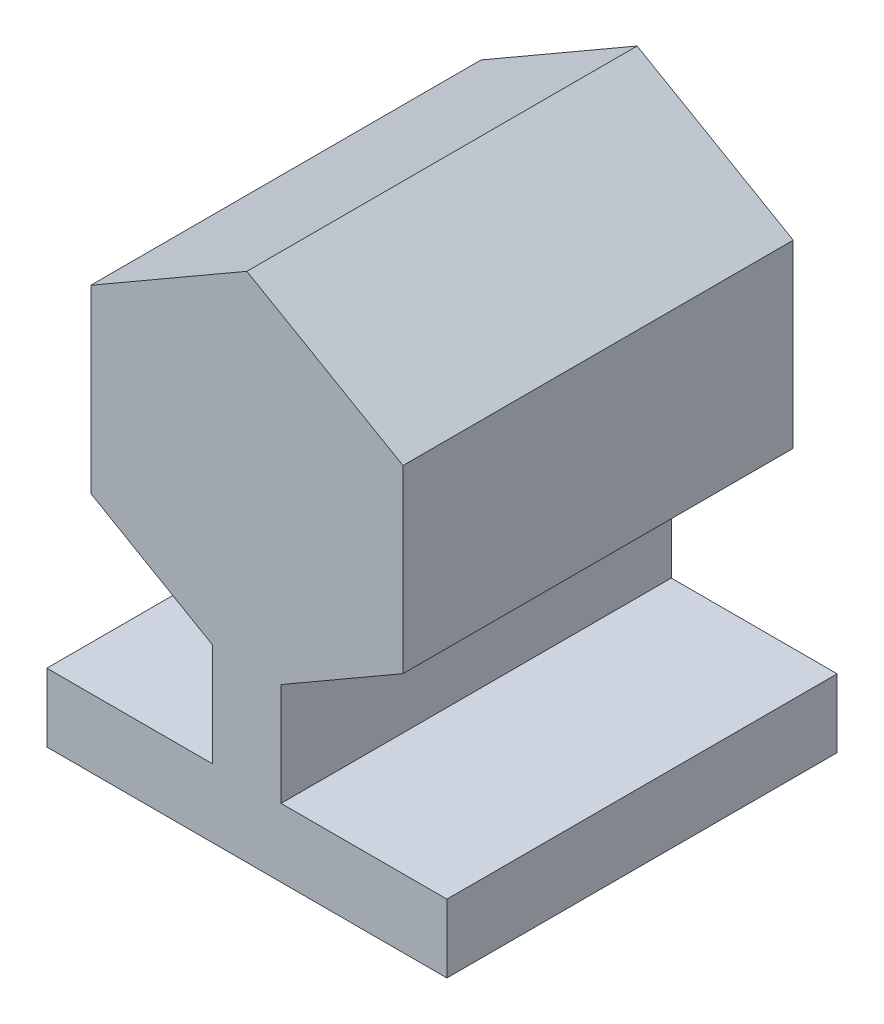
ISO-10303-21;
HEADER;
FILE_DESCRIPTION(('STEP AP214'),'2;1');
FILE_NAME('part.step','',(''),(''),'','','');
FILE_SCHEMA(('AUTOMOTIVE_DESIGN { 1 0 10303 214 1 1 1 1 }'));
ENDSEC;
DATA;
#1=APPLICATION_CONTEXT('core data for automotive mechanical design processes');
#2=APPLICATION_PROTOCOL_DEFINITION('international standard','automotive_design',2000,#1);
#3=PRODUCT_CONTEXT('',#1,'mechanical');
#4=PRODUCT('Part','Part','',(#3));
#5=PRODUCT_RELATED_PRODUCT_CATEGORY('part','',(#4));
#6=PRODUCT_DEFINITION_FORMATION('','',#4);
#7=PRODUCT_DEFINITION_CONTEXT('part definition',#1,'design');
#8=PRODUCT_DEFINITION('design','',#6,#7);
#9=PRODUCT_DEFINITION_SHAPE('','',#8);
#10=(LENGTH_UNIT() NAMED_UNIT(*) SI_UNIT(.MILLI.,.METRE.));
#11=(NAMED_UNIT(*) PLANE_ANGLE_UNIT() SI_UNIT($,.RADIAN.));
#12=(NAMED_UNIT(*) SI_UNIT($,.STERADIAN.) SOLID_ANGLE_UNIT());
#13=UNCERTAINTY_MEASURE_WITH_UNIT(LENGTH_MEASURE(1.E-05),#10,'distance_accuracy_value','');
#14=(GEOMETRIC_REPRESENTATION_CONTEXT(3) GLOBAL_UNCERTAINTY_ASSIGNED_CONTEXT((#13)) GLOBAL_UNIT_ASSIGNED_CONTEXT((#10,
#11,#12)) REPRESENTATION_CONTEXT('',''));
#15=CARTESIAN_POINT('',(0.,0.,0.));
#16=DIRECTION('',(0.,0.,1.));
#17=DIRECTION('',(1.,0.,0.));
#18=AXIS2_PLACEMENT_3D('',#15,#16,#17);
#19=CARTESIAN_POINT('',(-102500.,-170000.,200000.));
#20=DIRECTION('',(1.,0.,0.));
#21=DIRECTION('',(0.,0.,-1.));
#22=AXIS2_PLACEMENT_3D('',#19,#20,#21);
#23=PLANE('',#22);
#24=DIRECTION('',(0.,-1.,0.));
#25=VECTOR('',#24,1.);
#26=CARTESIAN_POINT('',(-102500.,-170000.,0.));
#27=LINE('',#26,#25);
#28=CARTESIAN_POINT('',(-102500.,-135000.,0.));
#29=VERTEX_POINT('',#28);
#30=CARTESIAN_POINT('',(-102500.,-170000.,0.));
#31=VERTEX_POINT('',#30);
#32=EDGE_CURVE('E159',#29,#31,#27,.T.);
#33=ORIENTED_EDGE('',*,*,#32,.T.);
#34=DIRECTION('',(0.,0.,-1.));
#35=VECTOR('',#34,1.);
#36=CARTESIAN_POINT('',(-102500.,-170000.,200000.));
#37=LINE('',#36,#35);
#38=CARTESIAN_POINT('',(-102500.,-170000.,200000.));
#39=VERTEX_POINT('',#38);
#40=EDGE_CURVE('E11',#39,#31,#37,.T.);
#41=ORIENTED_EDGE('',*,*,#40,.F.);
#42=DIRECTION('',(0.,-1.,0.));
#43=VECTOR('',#42,1.);
#44=CARTESIAN_POINT('',(-102500.,-170000.,200000.));
#45=LINE('',#44,#43);
#46=CARTESIAN_POINT('',(-102500.,-135000.,200000.));
#47=VERTEX_POINT('',#46);
#48=EDGE_CURVE('E183',#47,#39,#45,.T.);
#49=ORIENTED_EDGE('',*,*,#48,.F.);
#50=DIRECTION('',(0.,0.,-1.));
#51=VECTOR('',#50,1.);
#52=CARTESIAN_POINT('',(-102500.,-135000.,200000.));
#53=LINE('',#52,#51);
#54=EDGE_CURVE('E155',#47,#29,#53,.T.);
#55=ORIENTED_EDGE('',*,*,#54,.T.);
#56=EDGE_LOOP('',(#33,#41,#49,#55));
#57=FACE_BOUND('',#56,.T.);
#58=ADVANCED_FACE('F33',(#57),#23,.F.);
#59=CARTESIAN_POINT('',(-102500.,-170000.,200000.));
#60=DIRECTION('',(0.,1.,0.));
#61=DIRECTION('',(0.,0.,1.));
#62=AXIS2_PLACEMENT_3D('',#59,#60,#61);
#63=PLANE('',#62);
#64=DIRECTION('',(1.,0.,0.));
#65=VECTOR('',#64,1.);
#66=CARTESIAN_POINT('',(-102500.,-170000.,0.));
#67=LINE('',#66,#65);
#68=CARTESIAN_POINT('',(102500.,-170000.,0.));
#69=VERTEX_POINT('',#68);
#70=EDGE_CURVE('E162',#31,#69,#67,.T.);
#71=ORIENTED_EDGE('',*,*,#70,.T.);
#72=DIRECTION('',(0.,0.,-1.));
#73=VECTOR('',#72,1.);
#74=CARTESIAN_POINT('',(102500.,-170000.,200000.));
#75=LINE('',#74,#73);
#76=CARTESIAN_POINT('',(102500.,-170000.,200000.));
#77=VERTEX_POINT('',#76);
#78=EDGE_CURVE('E41',#77,#69,#75,.T.);
#79=ORIENTED_EDGE('',*,*,#78,.F.);
#80=DIRECTION('',(1.,0.,0.));
#81=VECTOR('',#80,1.);
#82=CARTESIAN_POINT('',(-102500.,-170000.,200000.));
#83=LINE('',#82,#81);
#84=EDGE_CURVE('E107',#39,#77,#83,.T.);
#85=ORIENTED_EDGE('',*,*,#84,.F.);
#86=ORIENTED_EDGE('',*,*,#40,.T.);
#87=EDGE_LOOP('',(#71,#79,#85,#86));
#88=FACE_BOUND('',#87,.T.);
#89=ADVANCED_FACE('F266',(#88),#63,.F.);
#90=CARTESIAN_POINT('',(102500.,-170000.,200000.));
#91=DIRECTION('',(-1.,0.,0.));
#92=DIRECTION('',(0.,0.,1.));
#93=AXIS2_PLACEMENT_3D('',#90,#91,#92);
#94=PLANE('',#93);
#95=DIRECTION('',(0.,1.,0.));
#96=VECTOR('',#95,1.);
#97=CARTESIAN_POINT('',(102500.,-170000.,0.));
#98=LINE('',#97,#96);
#99=CARTESIAN_POINT('',(102500.,-135000.,0.));
#100=VERTEX_POINT('',#99);
#101=EDGE_CURVE('E164',#69,#100,#98,.T.);
#102=ORIENTED_EDGE('',*,*,#101,.T.);
#103=DIRECTION('',(0.,0.,-1.));
#104=VECTOR('',#103,1.);
#105=CARTESIAN_POINT('',(102500.,-135000.,200000.));
#106=LINE('',#105,#104);
#107=CARTESIAN_POINT('',(102500.,-135000.,200000.));
#108=VERTEX_POINT('',#107);
#109=EDGE_CURVE('E205',#108,#100,#106,.T.);
#110=ORIENTED_EDGE('',*,*,#109,.F.);
#111=DIRECTION('',(0.,1.,0.));
#112=VECTOR('',#111,1.);
#113=CARTESIAN_POINT('',(102500.,-170000.,200000.));
#114=LINE('',#113,#112);
#115=EDGE_CURVE('E213',#77,#108,#114,.T.);
#116=ORIENTED_EDGE('',*,*,#115,.F.);
#117=ORIENTED_EDGE('',*,*,#78,.T.);
#118=EDGE_LOOP('',(#102,#110,#116,#117));
#119=FACE_BOUND('',#118,.T.);
#120=ADVANCED_FACE('F211',(#119),#94,.F.);
#121=CARTESIAN_POINT('',(102500.,-135000.,200000.));
#122=DIRECTION('',(0.,-1.,0.));
#123=DIRECTION('',(1.,0.,0.));
#124=AXIS2_PLACEMENT_3D('',#121,#122,#123);
#125=PLANE('',#124);
#126=DIRECTION('',(-1.,0.,0.));
#127=VECTOR('',#126,1.);
#128=CARTESIAN_POINT('',(102500.,-135000.,0.));
#129=LINE('',#128,#127);
#130=CARTESIAN_POINT('',(17500.,-135000.,0.));
#131=VERTEX_POINT('',#130);
#132=EDGE_CURVE('E166',#100,#131,#129,.T.);
#133=ORIENTED_EDGE('',*,*,#132,.T.);
#134=DIRECTION('',(0.,0.,-1.));
#135=VECTOR('',#134,1.);
#136=CARTESIAN_POINT('',(17500.,-135000.,200000.));
#137=LINE('',#136,#135);
#138=CARTESIAN_POINT('',(17500.,-135000.,200000.));
#139=VERTEX_POINT('',#138);
#140=EDGE_CURVE('E202',#139,#131,#137,.T.);
#141=ORIENTED_EDGE('',*,*,#140,.F.);
#142=DIRECTION('',(-1.,0.,0.));
#143=VECTOR('',#142,1.);
#144=CARTESIAN_POINT('',(102500.,-135000.,200000.));
#145=LINE('',#144,#143);
#146=EDGE_CURVE('E231',#108,#139,#145,.T.);
#147=ORIENTED_EDGE('',*,*,#146,.F.);
#148=ORIENTED_EDGE('',*,*,#109,.T.);
#149=EDGE_LOOP('',(#133,#141,#147,#148));
#150=FACE_BOUND('',#149,.T.);
#151=ADVANCED_FACE('F222',(#150),#125,.F.);
#152=CARTESIAN_POINT('',(17500.,-135000.,200000.));
#153=DIRECTION('',(-1.,0.,0.));
#154=DIRECTION('',(0.,0.,1.));
#155=AXIS2_PLACEMENT_3D('',#152,#153,#154);
#156=PLANE('',#155);
#157=DIRECTION('',(0.,1.,0.));
#158=VECTOR('',#157,1.);
#159=CARTESIAN_POINT('',(17500.,-135000.,0.));
#160=LINE('',#159,#158);
#161=CARTESIAN_POINT('',(17500.,-82272.4133595217,0.));
#162=VERTEX_POINT('',#161);
#163=EDGE_CURVE('E168',#131,#162,#160,.T.);
#164=ORIENTED_EDGE('',*,*,#163,.T.);
#165=DIRECTION('',(0.,0.,-1.));
#166=VECTOR('',#165,1.);
#167=CARTESIAN_POINT('',(17500.,-82272.4133595217,200000.));
#168=LINE('',#167,#166);
#169=CARTESIAN_POINT('',(17500.,-82272.4133595217,200000.));
#170=VERTEX_POINT('',#169);
#171=EDGE_CURVE('E199',#170,#162,#168,.T.);
#172=ORIENTED_EDGE('',*,*,#171,.F.);
#173=DIRECTION('',(0.,1.,0.));
#174=VECTOR('',#173,1.);
#175=CARTESIAN_POINT('',(17500.,-135000.,200000.));
#176=LINE('',#175,#174);
#177=EDGE_CURVE('E228',#139,#170,#176,.T.);
#178=ORIENTED_EDGE('',*,*,#177,.F.);
#179=ORIENTED_EDGE('',*,*,#140,.T.);
#180=EDGE_LOOP('',(#164,#172,#178,#179));
#181=FACE_BOUND('',#180,.T.);
#182=ADVANCED_FACE('F226',(#181),#156,.F.);
#183=CARTESIAN_POINT('',(17500.,-82272.4133595217,200000.));
#184=DIRECTION('',(-0.5,0.866025403784438,0.));
#185=DIRECTION('',(-0.866025403784438,-0.5,0.));
#186=AXIS2_PLACEMENT_3D('',#183,#184,#185);
#187=PLANE('',#186);
#188=DIRECTION('',(0.866025403784438,0.5,0.));
#189=VECTOR('',#188,1.);
#190=CARTESIAN_POINT('',(17500.,-82272.4133595217,0.));
#191=LINE('',#190,#189);
#192=CARTESIAN_POINT('',(80000.,-46188.02153517,0.));
#193=VERTEX_POINT('',#192);
#194=EDGE_CURVE('E170',#162,#193,#191,.T.);
#195=ORIENTED_EDGE('',*,*,#194,.T.);
#196=DIRECTION('',(0.,0.,-1.));
#197=VECTOR('',#196,1.);
#198=CARTESIAN_POINT('',(80000.,-46188.02153517,200000.));
#199=LINE('',#198,#197);
#200=CARTESIAN_POINT('',(80000.,-46188.02153517,200000.));
#201=VERTEX_POINT('',#200);
#202=EDGE_CURVE('E196',#201,#193,#199,.T.);
#203=ORIENTED_EDGE('',*,*,#202,.F.);
#204=DIRECTION('',(0.866025403784438,0.5,0.));
#205=VECTOR('',#204,1.);
#206=CARTESIAN_POINT('',(17500.,-82272.4133595217,200000.));
#207=LINE('',#206,#205);
#208=EDGE_CURVE('E230',#170,#201,#207,.T.);
#209=ORIENTED_EDGE('',*,*,#208,.F.);
#210=ORIENTED_EDGE('',*,*,#171,.T.);
#211=EDGE_LOOP('',(#195,#203,#209,#210));
#212=FACE_BOUND('',#211,.T.);
#213=ADVANCED_FACE('F279',(#212),#187,.F.);
#214=CARTESIAN_POINT('',(80000.,-46188.02153517,200000.));
#215=DIRECTION('',(-1.,0.,0.));
#216=DIRECTION('',(0.,-1.,0.));
#217=AXIS2_PLACEMENT_3D('',#214,#215,#216);
#218=PLANE('',#217);
#219=DIRECTION('',(0.,1.,0.));
#220=VECTOR('',#219,1.);
#221=CARTESIAN_POINT('',(80000.,-46188.02153517,0.));
#222=LINE('',#221,#220);
#223=CARTESIAN_POINT('',(80000.,46188.0215351701,0.));
#224=VERTEX_POINT('',#223);
#225=EDGE_CURVE('E172',#193,#224,#222,.T.);
#226=ORIENTED_EDGE('',*,*,#225,.T.);
#227=DIRECTION('',(0.,0.,-1.));
#228=VECTOR('',#227,1.);
#229=CARTESIAN_POINT('',(80000.,46188.0215351701,200000.));
#230=LINE('',#229,#228);
#231=CARTESIAN_POINT('',(80000.,46188.0215351701,200000.));
#232=VERTEX_POINT('',#231);
#233=EDGE_CURVE('E193',#232,#224,#230,.T.);
#234=ORIENTED_EDGE('',*,*,#233,.F.);
#235=DIRECTION('',(0.,1.,0.));
#236=VECTOR('',#235,1.);
#237=CARTESIAN_POINT('',(80000.,-46188.02153517,200000.));
#238=LINE('',#237,#236);
#239=EDGE_CURVE('E233',#201,#232,#238,.T.);
#240=ORIENTED_EDGE('',*,*,#239,.F.);
#241=ORIENTED_EDGE('',*,*,#202,.T.);
#242=EDGE_LOOP('',(#226,#234,#240,#241));
#243=FACE_BOUND('',#242,.T.);
#244=ADVANCED_FACE('F282',(#243),#218,.F.);
#245=CARTESIAN_POINT('',(80000.,46188.0215351701,200000.));
#246=DIRECTION('',(-0.5,-0.866025403784439,0.));
#247=DIRECTION('',(0.866025403784439,-0.5,0.));
#248=AXIS2_PLACEMENT_3D('',#245,#246,#247);
#249=PLANE('',#248);
#250=DIRECTION('',(-0.866025403784439,0.5,0.));
#251=VECTOR('',#250,1.);
#252=CARTESIAN_POINT('',(80000.,46188.0215351701,0.));
#253=LINE('',#252,#251);
#254=CARTESIAN_POINT('',(-2.87773574786147E-11,92376.0430703402,0.));
#255=VERTEX_POINT('',#254);
#256=EDGE_CURVE('E174',#224,#255,#253,.T.);
#257=ORIENTED_EDGE('',*,*,#256,.T.);
#258=DIRECTION('',(0.,0.,-1.));
#259=VECTOR('',#258,1.);
#260=CARTESIAN_POINT('',(-2.87773574786147E-11,92376.0430703402,200000.));
#261=LINE('',#260,#259);
#262=CARTESIAN_POINT('',(-2.87773574786147E-11,92376.0430703402,200000.));
#263=VERTEX_POINT('',#262);
#264=EDGE_CURVE('E190',#263,#255,#261,.T.);
#265=ORIENTED_EDGE('',*,*,#264,.F.);
#266=DIRECTION('',(-0.866025403784439,0.5,0.));
#267=VECTOR('',#266,1.);
#268=CARTESIAN_POINT('',(80000.,46188.0215351701,200000.));
#269=LINE('',#268,#267);
#270=EDGE_CURVE('E239',#232,#263,#269,.T.);
#271=ORIENTED_EDGE('',*,*,#270,.F.);
#272=ORIENTED_EDGE('',*,*,#233,.T.);
#273=EDGE_LOOP('',(#257,#265,#271,#272));
#274=FACE_BOUND('',#273,.T.);
#275=ADVANCED_FACE('F286',(#274),#249,.F.);
#276=CARTESIAN_POINT('',(-2.87773574786147E-11,92376.0430703402,200000.));
#277=DIRECTION('',(0.500000000000001,-0.866025403784438,0.));
#278=DIRECTION('',(0.866025403784438,0.500000000000001,0.));
#279=AXIS2_PLACEMENT_3D('',#276,#277,#278);
#280=PLANE('',#279);
#281=DIRECTION('',(-0.866025403784438,-0.500000000000001,0.));
#282=VECTOR('',#281,1.);
#283=CARTESIAN_POINT('',(-2.87773574786147E-11,92376.0430703402,0.));
#284=LINE('',#283,#282);
#285=CARTESIAN_POINT('',(-80000.0000000001,46188.02153517,0.));
#286=VERTEX_POINT('',#285);
#287=EDGE_CURVE('E176',#255,#286,#284,.T.);
#288=ORIENTED_EDGE('',*,*,#287,.T.);
#289=DIRECTION('',(0.,0.,-1.));
#290=VECTOR('',#289,1.);
#291=CARTESIAN_POINT('',(-80000.0000000001,46188.02153517,200000.));
#292=LINE('',#291,#290);
#293=CARTESIAN_POINT('',(-80000.0000000001,46188.02153517,200000.));
#294=VERTEX_POINT('',#293);
#295=EDGE_CURVE('E187',#294,#286,#292,.T.);
#296=ORIENTED_EDGE('',*,*,#295,.F.);
#297=DIRECTION('',(-0.866025403784438,-0.500000000000001,0.));
#298=VECTOR('',#297,1.);
#299=CARTESIAN_POINT('',(-2.87773574786147E-11,92376.0430703402,200000.));
#300=LINE('',#299,#298);
#301=EDGE_CURVE('E241',#263,#294,#300,.T.);
#302=ORIENTED_EDGE('',*,*,#301,.F.);
#303=ORIENTED_EDGE('',*,*,#264,.T.);
#304=EDGE_LOOP('',(#288,#296,#302,#303));
#305=FACE_BOUND('',#304,.T.);
#306=ADVANCED_FACE('F247',(#305),#280,.F.);
#307=CARTESIAN_POINT('',(-80000.0000000001,46188.02153517,200000.));
#308=DIRECTION('',(1.,0.,0.));
#309=DIRECTION('',(0.,1.,0.));
#310=AXIS2_PLACEMENT_3D('',#307,#308,#309);
#311=PLANE('',#310);
#312=DIRECTION('',(0.,-1.,0.));
#313=VECTOR('',#312,1.);
#314=CARTESIAN_POINT('',(-80000.0000000001,46188.02153517,0.));
#315=LINE('',#314,#313);
#316=CARTESIAN_POINT('',(-80000.,-46188.0215351701,0.));
#317=VERTEX_POINT('',#316);
#318=EDGE_CURVE('E178',#286,#317,#315,.T.);
#319=ORIENTED_EDGE('',*,*,#318,.T.);
#320=DIRECTION('',(0.,0.,-1.));
#321=VECTOR('',#320,1.);
#322=CARTESIAN_POINT('',(-80000.,-46188.0215351701,200000.));
#323=LINE('',#322,#321);
#324=CARTESIAN_POINT('',(-80000.,-46188.0215351701,200000.));
#325=VERTEX_POINT('',#324);
#326=EDGE_CURVE('E150',#325,#317,#323,.T.);
#327=ORIENTED_EDGE('',*,*,#326,.F.);
#328=DIRECTION('',(0.,-1.,0.));
#329=VECTOR('',#328,1.);
#330=CARTESIAN_POINT('',(-80000.0000000001,46188.02153517,200000.));
#331=LINE('',#330,#329);
#332=EDGE_CURVE('E141',#294,#325,#331,.T.);
#333=ORIENTED_EDGE('',*,*,#332,.F.);
#334=ORIENTED_EDGE('',*,*,#295,.T.);
#335=EDGE_LOOP('',(#319,#327,#333,#334));
#336=FACE_BOUND('',#335,.T.);
#337=ADVANCED_FACE('F251',(#336),#311,.F.);
#338=CARTESIAN_POINT('',(-80000.,-46188.0215351701,200000.));
#339=DIRECTION('',(0.5,0.866025403784439,0.));
#340=DIRECTION('',(-0.866025403784439,0.5,0.));
#341=AXIS2_PLACEMENT_3D('',#338,#339,#340);
#342=PLANE('',#341);
#343=DIRECTION('',(0.866025403784439,-0.5,0.));
#344=VECTOR('',#343,1.);
#345=CARTESIAN_POINT('',(-80000.,-46188.0215351701,0.));
#346=LINE('',#345,#344);
#347=CARTESIAN_POINT('',(-17500.,-82272.4133595217,0.));
#348=VERTEX_POINT('',#347);
#349=EDGE_CURVE('E149',#317,#348,#346,.T.);
#350=ORIENTED_EDGE('',*,*,#349,.T.);
#351=DIRECTION('',(0.,0.,-1.));
#352=VECTOR('',#351,1.);
#353=CARTESIAN_POINT('',(-17500.,-82272.4133595217,200000.));
#354=LINE('',#353,#352);
#355=CARTESIAN_POINT('',(-17500.,-82272.4133595217,200000.));
#356=VERTEX_POINT('',#355);
#357=EDGE_CURVE('E146',#356,#348,#354,.T.);
#358=ORIENTED_EDGE('',*,*,#357,.F.);
#359=DIRECTION('',(0.866025403784439,-0.5,0.));
#360=VECTOR('',#359,1.);
#361=CARTESIAN_POINT('',(-80000.,-46188.0215351701,200000.));
#362=LINE('',#361,#360);
#363=EDGE_CURVE('E135',#325,#356,#362,.T.);
#364=ORIENTED_EDGE('',*,*,#363,.F.);
#365=ORIENTED_EDGE('',*,*,#326,.T.);
#366=EDGE_LOOP('',(#350,#358,#364,#365));
#367=FACE_BOUND('',#366,.T.);
#368=ADVANCED_FACE('F147',(#367),#342,.F.);
#369=CARTESIAN_POINT('',(-17500.,-135000.,200000.));
#370=DIRECTION('',(1.,0.,0.));
#371=DIRECTION('',(0.,1.,0.));
#372=AXIS2_PLACEMENT_3D('',#369,#370,#371);
#373=PLANE('',#372);
#374=DIRECTION('',(0.,-1.,0.));
#375=VECTOR('',#374,1.);
#376=CARTESIAN_POINT('',(-17500.,-135000.,0.));
#377=LINE('',#376,#375);
#378=CARTESIAN_POINT('',(-17500.,-135000.,0.));
#379=VERTEX_POINT('',#378);
#380=EDGE_CURVE('E93',#348,#379,#377,.T.);
#381=ORIENTED_EDGE('',*,*,#380,.T.);
#382=DIRECTION('',(0.,0.,-1.));
#383=VECTOR('',#382,1.);
#384=CARTESIAN_POINT('',(-17500.,-135000.,200000.));
#385=LINE('',#384,#383);
#386=CARTESIAN_POINT('',(-17500.,-135000.,200000.));
#387=VERTEX_POINT('',#386);
#388=EDGE_CURVE('E151',#387,#379,#385,.T.);
#389=ORIENTED_EDGE('',*,*,#388,.F.);
#390=DIRECTION('',(0.,-1.,0.));
#391=VECTOR('',#390,1.);
#392=CARTESIAN_POINT('',(-17500.,-135000.,200000.));
#393=LINE('',#392,#391);
#394=EDGE_CURVE('E139',#356,#387,#393,.T.);
#395=ORIENTED_EDGE('',*,*,#394,.F.);
#396=ORIENTED_EDGE('',*,*,#357,.T.);
#397=EDGE_LOOP('',(#381,#389,#395,#396));
#398=FACE_BOUND('',#397,.T.);
#399=ADVANCED_FACE('F153',(#398),#373,.F.);
#400=CARTESIAN_POINT('',(-102500.,-135000.,200000.));
#401=DIRECTION('',(0.,-1.,0.));
#402=DIRECTION('',(1.,0.,0.));
#403=AXIS2_PLACEMENT_3D('',#400,#401,#402);
#404=PLANE('',#403);
#405=DIRECTION('',(-1.,0.,0.));
#406=VECTOR('',#405,1.);
#407=CARTESIAN_POINT('',(-102500.,-135000.,0.));
#408=LINE('',#407,#406);
#409=EDGE_CURVE('E99',#379,#29,#408,.T.);
#410=ORIENTED_EDGE('',*,*,#409,.T.);
#411=ORIENTED_EDGE('',*,*,#54,.F.);
#412=DIRECTION('',(-1.,0.,0.));
#413=VECTOR('',#412,1.);
#414=CARTESIAN_POINT('',(-102500.,-135000.,200000.));
#415=LINE('',#414,#413);
#416=EDGE_CURVE('E49',#387,#47,#415,.T.);
#417=ORIENTED_EDGE('',*,*,#416,.F.);
#418=ORIENTED_EDGE('',*,*,#388,.T.);
#419=EDGE_LOOP('',(#410,#411,#417,#418));
#420=FACE_BOUND('',#419,.T.);
#421=ADVANCED_FACE('F255',(#420),#404,.F.);
#422=CARTESIAN_POINT('',(0.,0.,200000.));
#423=DIRECTION('',(0.,0.,-1.));
#424=DIRECTION('',(-1.,0.,0.));
#425=AXIS2_PLACEMENT_3D('',#422,#423,#424);
#426=PLANE('',#425);
#427=ORIENTED_EDGE('',*,*,#48,.T.);
#428=ORIENTED_EDGE('',*,*,#84,.T.);
#429=ORIENTED_EDGE('',*,*,#115,.T.);
#430=ORIENTED_EDGE('',*,*,#146,.T.);
#431=ORIENTED_EDGE('',*,*,#177,.T.);
#432=ORIENTED_EDGE('',*,*,#208,.T.);
#433=ORIENTED_EDGE('',*,*,#239,.T.);
#434=ORIENTED_EDGE('',*,*,#270,.T.);
#435=ORIENTED_EDGE('',*,*,#301,.T.);
#436=ORIENTED_EDGE('',*,*,#332,.T.);
#437=ORIENTED_EDGE('',*,*,#363,.T.);
#438=ORIENTED_EDGE('',*,*,#394,.T.);
#439=ORIENTED_EDGE('',*,*,#416,.T.);
#440=EDGE_LOOP('',(#427,#428,#429,#430,#431,#432,#433,#434,#435,#436,#437,#438,#439));
#441=FACE_BOUND('',#440,.T.);
#442=ADVANCED_FACE('F137',(#441),#426,.F.);
#443=CARTESIAN_POINT('',(0.,0.,0.));
#444=DIRECTION('',(0.,0.,-1.));
#445=DIRECTION('',(-1.,0.,0.));
#446=AXIS2_PLACEMENT_3D('',#443,#444,#445);
#447=PLANE('',#446);
#448=ORIENTED_EDGE('',*,*,#32,.F.);
#449=ORIENTED_EDGE('',*,*,#409,.F.);
#450=ORIENTED_EDGE('',*,*,#380,.F.);
#451=ORIENTED_EDGE('',*,*,#349,.F.);
#452=ORIENTED_EDGE('',*,*,#318,.F.);
#453=ORIENTED_EDGE('',*,*,#287,.F.);
#454=ORIENTED_EDGE('',*,*,#256,.F.);
#455=ORIENTED_EDGE('',*,*,#225,.F.);
#456=ORIENTED_EDGE('',*,*,#194,.F.);
#457=ORIENTED_EDGE('',*,*,#163,.F.);
#458=ORIENTED_EDGE('',*,*,#132,.F.);
#459=ORIENTED_EDGE('',*,*,#101,.F.);
#460=ORIENTED_EDGE('',*,*,#70,.F.);
#461=EDGE_LOOP('',(#448,#449,#450,#451,#452,#453,#454,#455,#456,#457,#458,#459,#460));
#462=FACE_BOUND('',#461,.T.);
#463=ADVANCED_FACE('F217',(#462),#447,.T.);
#464=CLOSED_SHELL('',(#58,#89,#120,#151,#182,#213,#244,#275,#306,#337,#368,#399,#421,#442,#463));
#465=MANIFOLD_SOLID_BREP('B2',#464);
#466=ADVANCED_BREP_SHAPE_REPRESENTATION('',(#18,#465),#14);
#467=SHAPE_DEFINITION_REPRESENTATION(#9,#466);
ENDSEC;
END-ISO-10303-21;
